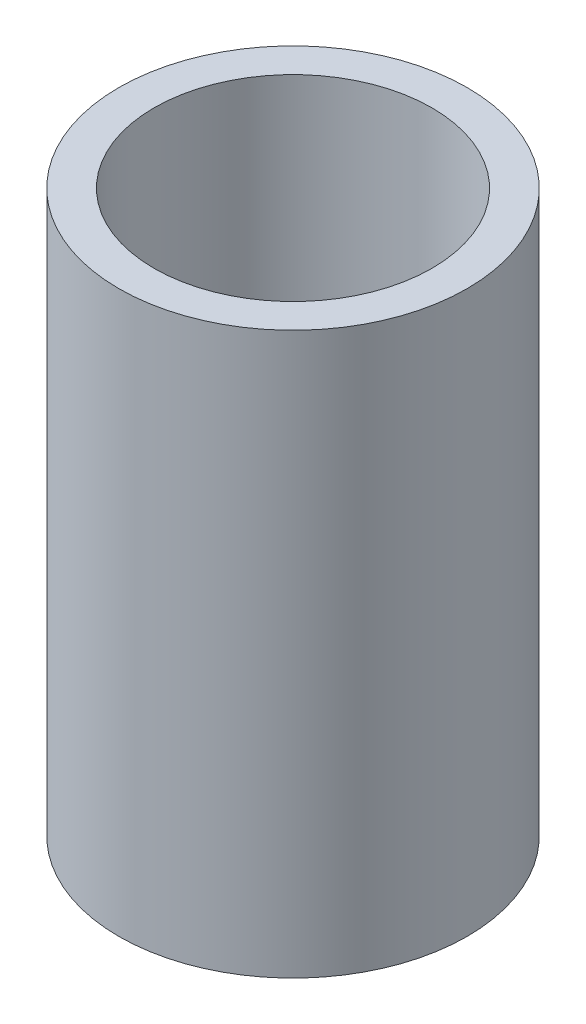
ISO-10303-21;
HEADER;
FILE_DESCRIPTION(('STEP AP214'),'2;1');
FILE_NAME('part.step','',(''),(''),'','','');
FILE_SCHEMA(('AUTOMOTIVE_DESIGN { 1 0 10303 214 1 1 1 1 }'));
ENDSEC;
DATA;
#1=APPLICATION_CONTEXT('core data for automotive mechanical design processes');
#2=APPLICATION_PROTOCOL_DEFINITION('international standard','automotive_design',2000,#1);
#3=PRODUCT_CONTEXT('',#1,'mechanical');
#4=PRODUCT('Part','Part','',(#3));
#5=PRODUCT_RELATED_PRODUCT_CATEGORY('part','',(#4));
#6=PRODUCT_DEFINITION_FORMATION('','',#4);
#7=PRODUCT_DEFINITION_CONTEXT('part definition',#1,'design');
#8=PRODUCT_DEFINITION('design','',#6,#7);
#9=PRODUCT_DEFINITION_SHAPE('','',#8);
#10=(LENGTH_UNIT() NAMED_UNIT(*) SI_UNIT(.MILLI.,.METRE.));
#11=(NAMED_UNIT(*) PLANE_ANGLE_UNIT() SI_UNIT($,.RADIAN.));
#12=(NAMED_UNIT(*) SI_UNIT($,.STERADIAN.) SOLID_ANGLE_UNIT());
#13=UNCERTAINTY_MEASURE_WITH_UNIT(LENGTH_MEASURE(1.E-05),#10,'distance_accuracy_value','');
#14=(GEOMETRIC_REPRESENTATION_CONTEXT(3) GLOBAL_UNCERTAINTY_ASSIGNED_CONTEXT((#13)) GLOBAL_UNIT_ASSIGNED_CONTEXT((#10,
#11,#12)) REPRESENTATION_CONTEXT('',''));
#15=CARTESIAN_POINT('',(0.,0.,0.));
#16=DIRECTION('',(0.,0.,1.));
#17=DIRECTION('',(1.,0.,0.));
#18=AXIS2_PLACEMENT_3D('',#15,#16,#17);
#19=CARTESIAN_POINT('',(0.,48.3228906629786,0.));
#20=DIRECTION('',(0.,-1.,0.));
#21=DIRECTION('',(0.,0.,-1.));
#22=AXIS2_PLACEMENT_3D('',#19,#20,#21);
#23=CYLINDRICAL_SURFACE('',#22,15.);
#24=CARTESIAN_POINT('',(0.,48.3228906629786,0.));
#25=DIRECTION('',(0.,1.,0.));
#26=DIRECTION('',(0.,0.,1.));
#27=AXIS2_PLACEMENT_3D('',#24,#25,#26);
#28=CIRCLE('',#27,15.);
#29=CARTESIAN_POINT('',(0.,48.3228906629786,15.));
#30=VERTEX_POINT('',#29);
#31=EDGE_CURVE('E10',#30,#30,#28,.T.);
#32=ORIENTED_EDGE('',*,*,#31,.F.);
#33=EDGE_LOOP('',(#32));
#34=FACE_BOUND('',#33,.T.);
#35=CARTESIAN_POINT('',(0.,0.,0.));
#36=DIRECTION('',(0.,1.,0.));
#37=DIRECTION('',(0.,0.,1.));
#38=AXIS2_PLACEMENT_3D('',#35,#36,#37);
#39=CIRCLE('',#38,15.);
#40=CARTESIAN_POINT('',(0.,0.,15.));
#41=VERTEX_POINT('',#40);
#42=EDGE_CURVE('E37',#41,#41,#39,.T.);
#43=ORIENTED_EDGE('',*,*,#42,.T.);
#44=EDGE_LOOP('',(#43));
#45=FACE_BOUND('',#44,.T.);
#46=ADVANCED_FACE('F40',(#34,#45),#23,.T.);
#47=CARTESIAN_POINT('',(0.,48.3228906629786,0.));
#48=DIRECTION('',(0.,1.,0.));
#49=DIRECTION('',(0.,0.,1.));
#50=AXIS2_PLACEMENT_3D('',#47,#48,#49);
#51=PLANE('',#50);
#52=CARTESIAN_POINT('',(0.,48.3228906629786,0.));
#53=DIRECTION('',(0.,1.,0.));
#54=DIRECTION('',(0.,0.,1.));
#55=AXIS2_PLACEMENT_3D('',#52,#53,#54);
#56=CIRCLE('',#55,11.9721533534598);
#57=CARTESIAN_POINT('',(0.,48.3228906629786,11.9721533534598));
#58=VERTEX_POINT('',#57);
#59=EDGE_CURVE('E50',#58,#58,#56,.T.);
#60=ORIENTED_EDGE('',*,*,#59,.F.);
#61=EDGE_LOOP('',(#60));
#62=FACE_BOUND('',#61,.T.);
#63=ORIENTED_EDGE('',*,*,#31,.T.);
#64=EDGE_LOOP('',(#63));
#65=FACE_BOUND('',#64,.T.);
#66=ADVANCED_FACE('F59',(#62,#65),#51,.T.);
#67=CARTESIAN_POINT('',(0.,0.,0.));
#68=DIRECTION('',(0.,1.,0.));
#69=DIRECTION('',(0.,0.,1.));
#70=AXIS2_PLACEMENT_3D('',#67,#68,#69);
#71=PLANE('',#70);
#72=CARTESIAN_POINT('',(0.,0.,0.));
#73=DIRECTION('',(0.,1.,0.));
#74=DIRECTION('',(0.,0.,1.));
#75=AXIS2_PLACEMENT_3D('',#72,#73,#74);
#76=CIRCLE('',#75,11.9721533534598);
#77=CARTESIAN_POINT('',(0.,0.,11.9721533534598));
#78=VERTEX_POINT('',#77);
#79=EDGE_CURVE('E47',#78,#78,#76,.T.);
#80=ORIENTED_EDGE('',*,*,#79,.T.);
#81=EDGE_LOOP('',(#80));
#82=FACE_BOUND('',#81,.T.);
#83=ORIENTED_EDGE('',*,*,#42,.F.);
#84=EDGE_LOOP('',(#83));
#85=FACE_BOUND('',#84,.T.);
#86=ADVANCED_FACE('F58',(#82,#85),#71,.F.);
#87=CARTESIAN_POINT('',(0.,48.3228906629786,0.));
#88=DIRECTION('',(0.,-1.,0.));
#89=DIRECTION('',(0.,0.,-1.));
#90=AXIS2_PLACEMENT_3D('',#87,#88,#89);
#91=CYLINDRICAL_SURFACE('',#90,11.9721533534598);
#92=ORIENTED_EDGE('',*,*,#59,.T.);
#93=EDGE_LOOP('',(#92));
#94=FACE_BOUND('',#93,.T.);
#95=ORIENTED_EDGE('',*,*,#79,.F.);
#96=EDGE_LOOP('',(#95));
#97=FACE_BOUND('',#96,.T.);
#98=ADVANCED_FACE('F54',(#94,#97),#91,.F.);
#99=CLOSED_SHELL('',(#46,#66,#86,#98));
#100=MANIFOLD_SOLID_BREP('B2',#99);
#101=ADVANCED_BREP_SHAPE_REPRESENTATION('',(#18,#100),#14);
#102=SHAPE_DEFINITION_REPRESENTATION(#9,#101);
ENDSEC;
END-ISO-10303-21;
